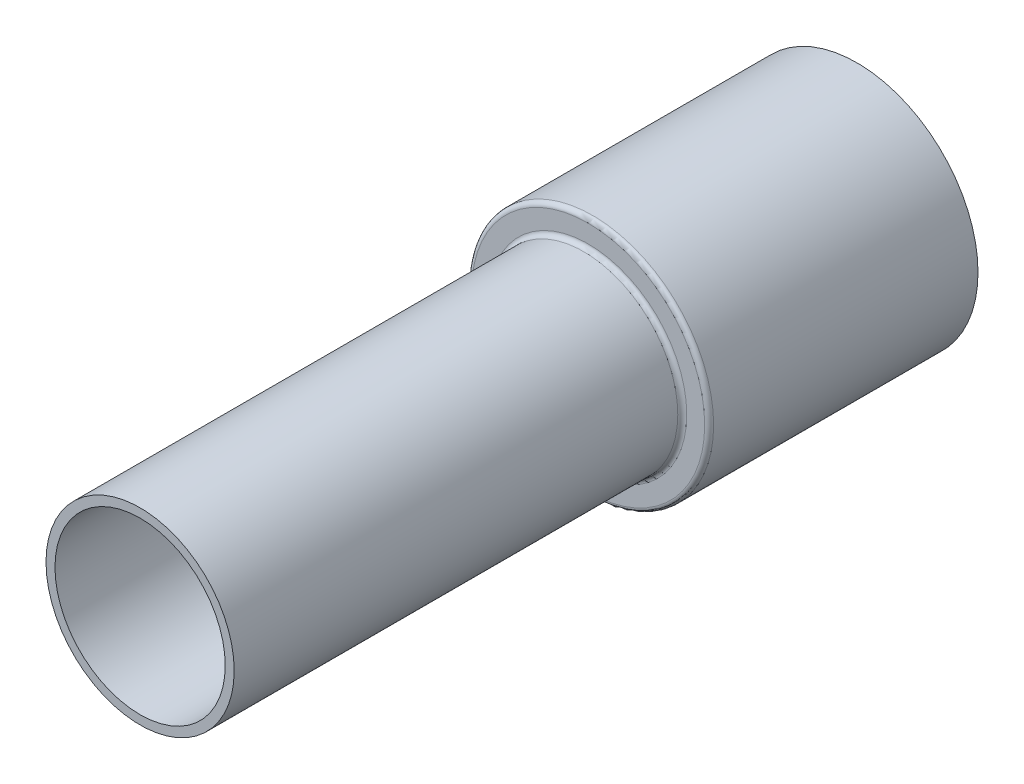
ISO-10303-21;
HEADER;
FILE_DESCRIPTION(('STEP AP214'),'2;1');
FILE_NAME('part.step','',(''),(''),'','','');
FILE_SCHEMA(('AUTOMOTIVE_DESIGN { 1 0 10303 214 1 1 1 1 }'));
ENDSEC;
DATA;
#1=APPLICATION_CONTEXT('core data for automotive mechanical design processes');
#2=APPLICATION_PROTOCOL_DEFINITION('international standard','automotive_design',2000,#1);
#3=PRODUCT_CONTEXT('',#1,'mechanical');
#4=PRODUCT('Part','Part','',(#3));
#5=PRODUCT_RELATED_PRODUCT_CATEGORY('part','',(#4));
#6=PRODUCT_DEFINITION_FORMATION('','',#4);
#7=PRODUCT_DEFINITION_CONTEXT('part definition',#1,'design');
#8=PRODUCT_DEFINITION('design','',#6,#7);
#9=PRODUCT_DEFINITION_SHAPE('','',#8);
#10=(LENGTH_UNIT() NAMED_UNIT(*) SI_UNIT(.MILLI.,.METRE.));
#11=(NAMED_UNIT(*) PLANE_ANGLE_UNIT() SI_UNIT($,.RADIAN.));
#12=(NAMED_UNIT(*) SI_UNIT($,.STERADIAN.) SOLID_ANGLE_UNIT());
#13=UNCERTAINTY_MEASURE_WITH_UNIT(LENGTH_MEASURE(1.E-05),#10,'distance_accuracy_value','');
#14=(GEOMETRIC_REPRESENTATION_CONTEXT(3) GLOBAL_UNCERTAINTY_ASSIGNED_CONTEXT((#13)) GLOBAL_UNIT_ASSIGNED_CONTEXT((#10,
#11,#12)) REPRESENTATION_CONTEXT('',''));
#15=CARTESIAN_POINT('',(0.,0.,0.));
#16=DIRECTION('',(0.,0.,1.));
#17=DIRECTION('',(1.,0.,0.));
#18=AXIS2_PLACEMENT_3D('',#15,#16,#17);
#19=CARTESIAN_POINT('',(0.,0.,-50.));
#20=DIRECTION('',(0.,0.,-1.));
#21=DIRECTION('',(-1.,0.,0.));
#22=AXIS2_PLACEMENT_3D('',#19,#20,#21);
#23=PLANE('',#22);
#24=CARTESIAN_POINT('',(0.,0.,-50.));
#25=DIRECTION('',(0.,0.,1.));
#26=DIRECTION('',(1.,0.,0.));
#27=AXIS2_PLACEMENT_3D('',#24,#25,#26);
#28=CIRCLE('',#27,11.);
#29=CARTESIAN_POINT('',(11.,0.,-50.));
#30=VERTEX_POINT('',#29);
#31=EDGE_CURVE('E10',#30,#30,#28,.T.);
#32=ORIENTED_EDGE('',*,*,#31,.F.);
#33=EDGE_LOOP('',(#32));
#34=FACE_BOUND('',#33,.T.);
#35=CARTESIAN_POINT('',(0.,0.,-50.));
#36=DIRECTION('',(0.,0.,1.));
#37=DIRECTION('',(1.,0.,0.));
#38=AXIS2_PLACEMENT_3D('',#35,#36,#37);
#39=CIRCLE('',#38,13.);
#40=CARTESIAN_POINT('',(13.,0.,-50.));
#41=VERTEX_POINT('',#40);
#42=EDGE_CURVE('E74',#41,#41,#39,.T.);
#43=ORIENTED_EDGE('',*,*,#42,.T.);
#44=EDGE_LOOP('',(#43));
#45=FACE_BOUND('',#44,.T.);
#46=ADVANCED_FACE('F34',(#34,#45),#23,.F.);
#47=CARTESIAN_POINT('',(0.,0.,-49.5));
#48=DIRECTION('',(0.,0.,1.));
#49=DIRECTION('',(1.,0.,0.));
#50=AXIS2_PLACEMENT_3D('',#47,#48,#49);
#51=TOROIDAL_SURFACE('',#50,11.,0.5);
#52=CARTESIAN_POINT('',(0.,0.,-49.5));
#53=DIRECTION('',(0.,0.,1.));
#54=DIRECTION('',(1.,0.,0.));
#55=AXIS2_PLACEMENT_3D('',#52,#53,#54);
#56=CIRCLE('',#55,10.5);
#57=CARTESIAN_POINT('',(10.5,0.,-49.5));
#58=VERTEX_POINT('',#57);
#59=EDGE_CURVE('E40',#58,#58,#56,.T.);
#60=ORIENTED_EDGE('',*,*,#59,.F.);
#61=EDGE_LOOP('',(#60));
#62=FACE_BOUND('',#61,.T.);
#63=ORIENTED_EDGE('',*,*,#31,.T.);
#64=EDGE_LOOP('',(#63));
#65=FACE_BOUND('',#64,.T.);
#66=ADVANCED_FACE('F91',(#62,#65),#51,.F.);
#67=CARTESIAN_POINT('',(0.,0.,0.));
#68=DIRECTION('',(0.,0.,1.));
#69=DIRECTION('',(1.,0.,0.));
#70=AXIS2_PLACEMENT_3D('',#67,#68,#69);
#71=CYLINDRICAL_SURFACE('',#70,10.5);
#72=ORIENTED_EDGE('',*,*,#59,.T.);
#73=EDGE_LOOP('',(#72));
#74=FACE_BOUND('',#73,.T.);
#75=CARTESIAN_POINT('',(0.,0.,0.));
#76=DIRECTION('',(0.,0.,1.));
#77=DIRECTION('',(1.,0.,0.));
#78=AXIS2_PLACEMENT_3D('',#75,#76,#77);
#79=CIRCLE('',#78,10.5);
#80=CARTESIAN_POINT('',(10.5,0.,0.));
#81=VERTEX_POINT('',#80);
#82=EDGE_CURVE('E44',#81,#81,#79,.T.);
#83=ORIENTED_EDGE('',*,*,#82,.F.);
#84=EDGE_LOOP('',(#83));
#85=FACE_BOUND('',#84,.T.);
#86=ADVANCED_FACE('F96',(#74,#85),#71,.T.);
#87=CARTESIAN_POINT('',(0.,0.,0.));
#88=DIRECTION('',(0.,0.,-1.));
#89=DIRECTION('',(-1.,0.,0.));
#90=AXIS2_PLACEMENT_3D('',#87,#88,#89);
#91=PLANE('',#90);
#92=CARTESIAN_POINT('',(0.,0.,0.));
#93=DIRECTION('',(0.,0.,1.));
#94=DIRECTION('',(1.,0.,0.));
#95=AXIS2_PLACEMENT_3D('',#92,#93,#94);
#96=CIRCLE('',#95,9.5);
#97=CARTESIAN_POINT('',(9.5,0.,0.));
#98=VERTEX_POINT('',#97);
#99=EDGE_CURVE('E48',#98,#98,#96,.T.);
#100=ORIENTED_EDGE('',*,*,#99,.F.);
#101=EDGE_LOOP('',(#100));
#102=FACE_BOUND('',#101,.T.);
#103=ORIENTED_EDGE('',*,*,#82,.T.);
#104=EDGE_LOOP('',(#103));
#105=FACE_BOUND('',#104,.T.);
#106=ADVANCED_FACE('F101',(#102,#105),#91,.F.);
#107=CARTESIAN_POINT('',(0.,0.,0.));
#108=DIRECTION('',(0.,0.,1.));
#109=DIRECTION('',(1.,0.,0.));
#110=AXIS2_PLACEMENT_3D('',#107,#108,#109);
#111=CYLINDRICAL_SURFACE('',#110,9.5);
#112=CARTESIAN_POINT('',(0.,0.,-50.5));
#113=DIRECTION('',(0.,0.,1.));
#114=DIRECTION('',(1.,0.,0.));
#115=AXIS2_PLACEMENT_3D('',#112,#113,#114);
#116=CIRCLE('',#115,9.5);
#117=CARTESIAN_POINT('',(9.5,0.,-50.5));
#118=VERTEX_POINT('',#117);
#119=EDGE_CURVE('E53',#118,#118,#116,.T.);
#120=ORIENTED_EDGE('',*,*,#119,.F.);
#121=EDGE_LOOP('',(#120));
#122=FACE_BOUND('',#121,.T.);
#123=ORIENTED_EDGE('',*,*,#99,.T.);
#124=EDGE_LOOP('',(#123));
#125=FACE_BOUND('',#124,.T.);
#126=ADVANCED_FACE('F106',(#122,#125),#111,.F.);
#127=CARTESIAN_POINT('',(0.,0.,-50.5));
#128=DIRECTION('',(0.,0.,1.));
#129=DIRECTION('',(1.,0.,0.));
#130=AXIS2_PLACEMENT_3D('',#127,#128,#129);
#131=TOROIDAL_SURFACE('',#130,10.,0.5);
#132=CARTESIAN_POINT('',(0.,0.,-51.));
#133=DIRECTION('',(0.,0.,1.));
#134=DIRECTION('',(1.,0.,0.));
#135=AXIS2_PLACEMENT_3D('',#132,#133,#134);
#136=CIRCLE('',#135,10.);
#137=CARTESIAN_POINT('',(10.,0.,-51.));
#138=VERTEX_POINT('',#137);
#139=EDGE_CURVE('E56',#138,#138,#136,.T.);
#140=ORIENTED_EDGE('',*,*,#139,.F.);
#141=EDGE_LOOP('',(#140));
#142=FACE_BOUND('',#141,.T.);
#143=ORIENTED_EDGE('',*,*,#119,.T.);
#144=EDGE_LOOP('',(#143));
#145=FACE_BOUND('',#144,.T.);
#146=ADVANCED_FACE('F110',(#142,#145),#131,.T.);
#147=CARTESIAN_POINT('',(0.,0.,-51.));
#148=DIRECTION('',(0.,0.,-1.));
#149=DIRECTION('',(-1.,0.,0.));
#150=AXIS2_PLACEMENT_3D('',#147,#148,#149);
#151=PLANE('',#150);
#152=ORIENTED_EDGE('',*,*,#139,.T.);
#153=EDGE_LOOP('',(#152));
#154=FACE_BOUND('',#153,.T.);
#155=CARTESIAN_POINT('',(0.,0.,-51.));
#156=DIRECTION('',(0.,0.,1.));
#157=DIRECTION('',(1.,0.,0.));
#158=AXIS2_PLACEMENT_3D('',#155,#156,#157);
#159=CIRCLE('',#158,12.);
#160=CARTESIAN_POINT('',(12.,0.,-51.));
#161=VERTEX_POINT('',#160);
#162=EDGE_CURVE('E59',#161,#161,#159,.T.);
#163=ORIENTED_EDGE('',*,*,#162,.F.);
#164=EDGE_LOOP('',(#163));
#165=FACE_BOUND('',#164,.T.);
#166=ADVANCED_FACE('F114',(#154,#165),#151,.T.);
#167=CARTESIAN_POINT('',(0.,0.,-51.5));
#168=DIRECTION('',(0.,0.,1.));
#169=DIRECTION('',(1.,0.,0.));
#170=AXIS2_PLACEMENT_3D('',#167,#168,#169);
#171=TOROIDAL_SURFACE('',#170,12.,0.5);
#172=CARTESIAN_POINT('',(0.,0.,-51.5));
#173=DIRECTION('',(0.,0.,1.));
#174=DIRECTION('',(1.,0.,0.));
#175=AXIS2_PLACEMENT_3D('',#172,#173,#174);
#176=CIRCLE('',#175,12.5);
#177=CARTESIAN_POINT('',(12.5,0.,-51.5));
#178=VERTEX_POINT('',#177);
#179=EDGE_CURVE('E62',#178,#178,#176,.T.);
#180=ORIENTED_EDGE('',*,*,#179,.F.);
#181=EDGE_LOOP('',(#180));
#182=FACE_BOUND('',#181,.T.);
#183=ORIENTED_EDGE('',*,*,#162,.T.);
#184=EDGE_LOOP('',(#183));
#185=FACE_BOUND('',#184,.T.);
#186=ADVANCED_FACE('F118',(#182,#185),#171,.F.);
#187=CARTESIAN_POINT('',(0.,0.,0.));
#188=DIRECTION('',(0.,0.,1.));
#189=DIRECTION('',(1.,0.,0.));
#190=AXIS2_PLACEMENT_3D('',#187,#188,#189);
#191=CYLINDRICAL_SURFACE('',#190,12.5);
#192=CARTESIAN_POINT('',(0.,0.,-80.));
#193=DIRECTION('',(0.,0.,1.));
#194=DIRECTION('',(1.,0.,0.));
#195=AXIS2_PLACEMENT_3D('',#192,#193,#194);
#196=CIRCLE('',#195,12.5);
#197=CARTESIAN_POINT('',(12.5,0.,-80.));
#198=VERTEX_POINT('',#197);
#199=EDGE_CURVE('E65',#198,#198,#196,.T.);
#200=ORIENTED_EDGE('',*,*,#199,.F.);
#201=EDGE_LOOP('',(#200));
#202=FACE_BOUND('',#201,.T.);
#203=ORIENTED_EDGE('',*,*,#179,.T.);
#204=EDGE_LOOP('',(#203));
#205=FACE_BOUND('',#204,.T.);
#206=ADVANCED_FACE('F122',(#202,#205),#191,.F.);
#207=CARTESIAN_POINT('',(0.,0.,-80.));
#208=DIRECTION('',(0.,0.,-1.));
#209=DIRECTION('',(-1.,0.,0.));
#210=AXIS2_PLACEMENT_3D('',#207,#208,#209);
#211=PLANE('',#210);
#212=ORIENTED_EDGE('',*,*,#199,.T.);
#213=EDGE_LOOP('',(#212));
#214=FACE_BOUND('',#213,.T.);
#215=CARTESIAN_POINT('',(0.,0.,-80.));
#216=DIRECTION('',(0.,0.,1.));
#217=DIRECTION('',(1.,0.,0.));
#218=AXIS2_PLACEMENT_3D('',#215,#216,#217);
#219=CIRCLE('',#218,13.5);
#220=CARTESIAN_POINT('',(13.5,0.,-80.));
#221=VERTEX_POINT('',#220);
#222=EDGE_CURVE('E68',#221,#221,#219,.T.);
#223=ORIENTED_EDGE('',*,*,#222,.F.);
#224=EDGE_LOOP('',(#223));
#225=FACE_BOUND('',#224,.T.);
#226=ADVANCED_FACE('F87',(#214,#225),#211,.T.);
#227=CARTESIAN_POINT('',(0.,0.,0.));
#228=DIRECTION('',(0.,0.,1.));
#229=DIRECTION('',(1.,0.,0.));
#230=AXIS2_PLACEMENT_3D('',#227,#228,#229);
#231=CYLINDRICAL_SURFACE('',#230,13.5);
#232=ORIENTED_EDGE('',*,*,#222,.T.);
#233=EDGE_LOOP('',(#232));
#234=FACE_BOUND('',#233,.T.);
#235=CARTESIAN_POINT('',(0.,0.,-50.5));
#236=DIRECTION('',(0.,0.,1.));
#237=DIRECTION('',(1.,0.,0.));
#238=AXIS2_PLACEMENT_3D('',#235,#236,#237);
#239=CIRCLE('',#238,13.5);
#240=CARTESIAN_POINT('',(13.5,0.,-50.5));
#241=VERTEX_POINT('',#240);
#242=EDGE_CURVE('E71',#241,#241,#239,.T.);
#243=ORIENTED_EDGE('',*,*,#242,.F.);
#244=EDGE_LOOP('',(#243));
#245=FACE_BOUND('',#244,.T.);
#246=ADVANCED_FACE('F81',(#234,#245),#231,.T.);
#247=CARTESIAN_POINT('',(0.,0.,-50.5));
#248=DIRECTION('',(0.,0.,1.));
#249=DIRECTION('',(1.,0.,0.));
#250=AXIS2_PLACEMENT_3D('',#247,#248,#249);
#251=TOROIDAL_SURFACE('',#250,13.,0.5);
#252=ORIENTED_EDGE('',*,*,#242,.T.);
#253=EDGE_LOOP('',(#252));
#254=FACE_BOUND('',#253,.T.);
#255=ORIENTED_EDGE('',*,*,#42,.F.);
#256=EDGE_LOOP('',(#255));
#257=FACE_BOUND('',#256,.T.);
#258=ADVANCED_FACE('F79',(#254,#257),#251,.T.);
#259=CLOSED_SHELL('',(#46,#66,#86,#106,#126,#146,#166,#186,#206,#226,#246,#258));
#260=MANIFOLD_SOLID_BREP('B2',#259);
#261=ADVANCED_BREP_SHAPE_REPRESENTATION('',(#18,#260),#14);
#262=SHAPE_DEFINITION_REPRESENTATION(#9,#261);
ENDSEC;
END-ISO-10303-21;
